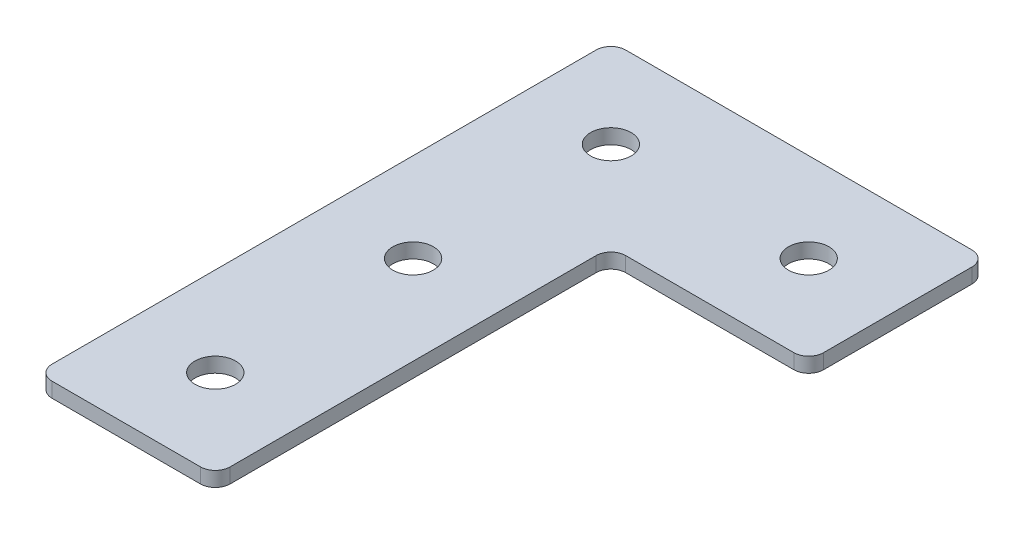
ISO-10303-21;
HEADER;
FILE_DESCRIPTION(('STEP AP214'),'2;1');
FILE_NAME('part.step','',(''),(''),'','','');
FILE_SCHEMA(('AUTOMOTIVE_DESIGN { 1 0 10303 214 1 1 1 1 }'));
ENDSEC;
DATA;
#1=APPLICATION_CONTEXT('core data for automotive mechanical design processes');
#2=APPLICATION_PROTOCOL_DEFINITION('international standard','automotive_design',2000,#1);
#3=PRODUCT_CONTEXT('',#1,'mechanical');
#4=PRODUCT('Part','Part','',(#3));
#5=PRODUCT_RELATED_PRODUCT_CATEGORY('part','',(#4));
#6=PRODUCT_DEFINITION_FORMATION('','',#4);
#7=PRODUCT_DEFINITION_CONTEXT('part definition',#1,'design');
#8=PRODUCT_DEFINITION('design','',#6,#7);
#9=PRODUCT_DEFINITION_SHAPE('','',#8);
#10=(LENGTH_UNIT() NAMED_UNIT(*) SI_UNIT(.MILLI.,.METRE.));
#11=(NAMED_UNIT(*) PLANE_ANGLE_UNIT() SI_UNIT($,.RADIAN.));
#12=(NAMED_UNIT(*) SI_UNIT($,.STERADIAN.) SOLID_ANGLE_UNIT());
#13=UNCERTAINTY_MEASURE_WITH_UNIT(LENGTH_MEASURE(1.E-05),#10,'distance_accuracy_value','');
#14=(GEOMETRIC_REPRESENTATION_CONTEXT(3) GLOBAL_UNCERTAINTY_ASSIGNED_CONTEXT((#13)) GLOBAL_UNIT_ASSIGNED_CONTEXT((#10,
#11,#12)) REPRESENTATION_CONTEXT('',''));
#15=CARTESIAN_POINT('',(0.,0.,0.));
#16=DIRECTION('',(0.,0.,1.));
#17=DIRECTION('',(1.,0.,0.));
#18=AXIS2_PLACEMENT_3D('',#15,#16,#17);
#19=CARTESIAN_POINT('',(-21.1576061309029,0.991348310286412,-41.3333372983197));
#20=DIRECTION('',(0.,-1.,0.));
#21=DIRECTION('',(0.,0.,-1.));
#22=AXIS2_PLACEMENT_3D('',#19,#20,#21);
#23=PLANE('',#22);
#24=CARTESIAN_POINT('',(-21.1576061309029,0.991348310286412,38.6666627016803));
#25=DIRECTION('',(0.,1.,0.));
#26=DIRECTION('',(0.,0.,1.));
#27=AXIS2_PLACEMENT_3D('',#24,#25,#26);
#28=CIRCLE('',#27,4.1);
#29=CARTESIAN_POINT('',(-21.1576061309029,0.991348310286412,42.7666627016803));
#30=VERTEX_POINT('',#29);
#31=EDGE_CURVE('E234',#30,#30,#28,.T.);
#32=ORIENTED_EDGE('',*,*,#31,.T.);
#33=EDGE_LOOP('',(#32));
#34=FACE_BOUND('',#33,.T.);
#35=CARTESIAN_POINT('',(-21.1576061309029,0.991348310286412,-1.33333729831971));
#36=DIRECTION('',(0.,1.,0.));
#37=DIRECTION('',(0.,0.,1.));
#38=AXIS2_PLACEMENT_3D('',#35,#36,#37);
#39=CIRCLE('',#38,4.1);
#40=CARTESIAN_POINT('',(-21.1576061309029,0.991348310286412,2.76666270168029));
#41=VERTEX_POINT('',#40);
#42=EDGE_CURVE('E228',#41,#41,#39,.T.);
#43=ORIENTED_EDGE('',*,*,#42,.T.);
#44=EDGE_LOOP('',(#43));
#45=FACE_BOUND('',#44,.T.);
#46=CARTESIAN_POINT('',(18.8423938690971,0.991348310286412,-41.3333372983197));
#47=DIRECTION('',(0.,1.,0.));
#48=DIRECTION('',(0.,0.,1.));
#49=AXIS2_PLACEMENT_3D('',#46,#47,#48);
#50=CIRCLE('',#49,4.1);
#51=CARTESIAN_POINT('',(18.8423938690971,0.991348310286412,-37.2333372983197));
#52=VERTEX_POINT('',#51);
#53=EDGE_CURVE('E222',#52,#52,#50,.T.);
#54=ORIENTED_EDGE('',*,*,#53,.T.);
#55=EDGE_LOOP('',(#54));
#56=FACE_BOUND('',#55,.T.);
#57=CARTESIAN_POINT('',(-21.1576061309029,0.991348310286412,-41.3333372983197));
#58=DIRECTION('',(0.,1.,0.));
#59=DIRECTION('',(0.,0.,1.));
#60=AXIS2_PLACEMENT_3D('',#57,#58,#59);
#61=CIRCLE('',#60,4.1);
#62=CARTESIAN_POINT('',(-21.1576061309029,0.991348310286412,-37.2333372983197));
#63=VERTEX_POINT('',#62);
#64=EDGE_CURVE('E201',#63,#63,#61,.T.);
#65=ORIENTED_EDGE('',*,*,#64,.T.);
#66=EDGE_LOOP('',(#65));
#67=FACE_BOUND('',#66,.T.);
#68=DIRECTION('',(1.,0.,0.));
#69=VECTOR('',#68,1.);
#70=CARTESIAN_POINT('',(-39.1576061309029,0.991348310286412,56.6666627016803));
#71=LINE('',#70,#69);
#72=CARTESIAN_POINT('',(-36.1576061309029,0.991348310286412,56.6666627016803));
#73=VERTEX_POINT('',#72);
#74=CARTESIAN_POINT('',(-6.15760613090292,0.991348310286412,56.6666627016803));
#75=VERTEX_POINT('',#74);
#76=EDGE_CURVE('E191',#73,#75,#71,.T.);
#77=ORIENTED_EDGE('',*,*,#76,.F.);
#78=CARTESIAN_POINT('',(-36.1576061309029,0.991348310286412,53.6666627016803));
#79=DIRECTION('',(0.,-1.,0.));
#80=DIRECTION('',(0.,0.,-1.));
#81=AXIS2_PLACEMENT_3D('',#78,#79,#80);
#82=CIRCLE('',#81,3.);
#83=CARTESIAN_POINT('',(-39.1576061309029,0.991348310286412,53.6666627016802));
#84=VERTEX_POINT('',#83);
#85=EDGE_CURVE('E158',#73,#84,#82,.T.);
#86=ORIENTED_EDGE('',*,*,#85,.T.);
#87=DIRECTION('',(0.,0.,1.));
#88=VECTOR('',#87,1.);
#89=CARTESIAN_POINT('',(-39.1576061309029,0.991348310286412,-59.3333372983197));
#90=LINE('',#89,#88);
#91=CARTESIAN_POINT('',(-39.1576061309029,0.991348310286412,-56.3333372983197));
#92=VERTEX_POINT('',#91);
#93=EDGE_CURVE('E194',#92,#84,#90,.T.);
#94=ORIENTED_EDGE('',*,*,#93,.F.);
#95=CARTESIAN_POINT('',(-36.1576061309029,0.991348310286412,-56.3333372983197));
#96=DIRECTION('',(0.,-1.,0.));
#97=DIRECTION('',(0.,0.,-1.));
#98=AXIS2_PLACEMENT_3D('',#95,#96,#97);
#99=CIRCLE('',#98,3.);
#100=CARTESIAN_POINT('',(-36.1576061309029,0.991348310286412,-59.3333372983197));
#101=VERTEX_POINT('',#100);
#102=EDGE_CURVE('E128',#92,#101,#99,.T.);
#103=ORIENTED_EDGE('',*,*,#102,.T.);
#104=DIRECTION('',(-1.,0.,0.));
#105=VECTOR('',#104,1.);
#106=CARTESIAN_POINT('',(36.8423938690971,0.991348310286412,-59.3333372983197));
#107=LINE('',#106,#105);
#108=CARTESIAN_POINT('',(33.8423938690971,0.991348310286412,-59.3333372983197));
#109=VERTEX_POINT('',#108);
#110=EDGE_CURVE('E213',#109,#101,#107,.T.);
#111=ORIENTED_EDGE('',*,*,#110,.F.);
#112=CARTESIAN_POINT('',(33.8423938690971,0.991348310286412,-56.3333372983198));
#113=DIRECTION('',(0.,-1.,0.));
#114=DIRECTION('',(0.,0.,-1.));
#115=AXIS2_PLACEMENT_3D('',#112,#113,#114);
#116=CIRCLE('',#115,3.);
#117=CARTESIAN_POINT('',(36.8423938690971,0.991348310286412,-56.3333372983198));
#118=VERTEX_POINT('',#117);
#119=EDGE_CURVE('E152',#109,#118,#116,.T.);
#120=ORIENTED_EDGE('',*,*,#119,.T.);
#121=DIRECTION('',(0.,0.,-1.));
#122=VECTOR('',#121,1.);
#123=CARTESIAN_POINT('',(36.8423938690971,0.991348310286412,-23.3333372983197));
#124=LINE('',#123,#122);
#125=CARTESIAN_POINT('',(36.8423938690971,0.991348310286412,-26.3333372983197));
#126=VERTEX_POINT('',#125);
#127=EDGE_CURVE('E187',#126,#118,#124,.T.);
#128=ORIENTED_EDGE('',*,*,#127,.F.);
#129=CARTESIAN_POINT('',(33.8423938690971,0.991348310286412,-26.3333372983197));
#130=DIRECTION('',(0.,-1.,0.));
#131=DIRECTION('',(0.,0.,-1.));
#132=AXIS2_PLACEMENT_3D('',#129,#130,#131);
#133=CIRCLE('',#132,3.);
#134=CARTESIAN_POINT('',(33.8423938690971,0.991348310286412,-23.3333372983197));
#135=VERTEX_POINT('',#134);
#136=EDGE_CURVE('E154',#126,#135,#133,.T.);
#137=ORIENTED_EDGE('',*,*,#136,.T.);
#138=DIRECTION('',(1.,0.,0.));
#139=VECTOR('',#138,1.);
#140=CARTESIAN_POINT('',(-3.15760613090292,0.991348310286412,-23.3333372983197));
#141=LINE('',#140,#139);
#142=CARTESIAN_POINT('',(-0.157606130902922,0.991348310286412,-23.3333372983197));
#143=VERTEX_POINT('',#142);
#144=EDGE_CURVE('E129',#143,#135,#141,.T.);
#145=ORIENTED_EDGE('',*,*,#144,.F.);
#146=CARTESIAN_POINT('',(-0.157606130902922,0.991348310286412,-20.3333372983197));
#147=DIRECTION('',(0.,-1.,0.));
#148=DIRECTION('',(0.,0.,-1.));
#149=AXIS2_PLACEMENT_3D('',#146,#147,#148);
#150=CIRCLE('',#149,3.);
#151=CARTESIAN_POINT('',(-3.15760613090292,0.991348310286412,-20.3333372983197));
#152=VERTEX_POINT('',#151);
#153=EDGE_CURVE('E10',#143,#152,#150,.F.);
#154=ORIENTED_EDGE('',*,*,#153,.T.);
#155=DIRECTION('',(0.,0.,-1.));
#156=VECTOR('',#155,1.);
#157=CARTESIAN_POINT('',(-3.15760613090292,0.991348310286412,56.6666627016803));
#158=LINE('',#157,#156);
#159=CARTESIAN_POINT('',(-3.15760613090292,0.991348310286412,53.6666627016803));
#160=VERTEX_POINT('',#159);
#161=EDGE_CURVE('E133',#160,#152,#158,.T.);
#162=ORIENTED_EDGE('',*,*,#161,.F.);
#163=CARTESIAN_POINT('',(-6.15760613090292,0.991348310286412,53.6666627016803));
#164=DIRECTION('',(0.,-1.,0.));
#165=DIRECTION('',(0.,0.,-1.));
#166=AXIS2_PLACEMENT_3D('',#163,#164,#165);
#167=CIRCLE('',#166,3.);
#168=EDGE_CURVE('E156',#160,#75,#167,.T.);
#169=ORIENTED_EDGE('',*,*,#168,.T.);
#170=EDGE_LOOP('',(#77,#86,#94,#103,#111,#120,#128,#137,#145,#154,#162,#169));
#171=FACE_BOUND('',#170,.T.);
#172=ADVANCED_FACE('F16',(#34,#45,#56,#67,#171),#23,.T.);
#173=CARTESIAN_POINT('',(36.8423938690971,0.991348310286412,-23.3333372983197));
#174=DIRECTION('',(1.,0.,0.));
#175=DIRECTION('',(0.,0.,-1.));
#176=AXIS2_PLACEMENT_3D('',#173,#174,#175);
#177=PLANE('',#176);
#178=DIRECTION('',(0.,0.,-1.));
#179=VECTOR('',#178,1.);
#180=CARTESIAN_POINT('',(36.8423938690971,3.99134831028641,-23.3333372983197));
#181=LINE('',#180,#179);
#182=CARTESIAN_POINT('',(36.8423938690971,3.99134831028641,-26.3333372983197));
#183=VERTEX_POINT('',#182);
#184=CARTESIAN_POINT('',(36.8423938690971,3.99134831028641,-56.3333372983198));
#185=VERTEX_POINT('',#184);
#186=EDGE_CURVE('E198',#183,#185,#181,.T.);
#187=ORIENTED_EDGE('',*,*,#186,.F.);
#188=DIRECTION('',(0.,1.,0.));
#189=VECTOR('',#188,1.);
#190=CARTESIAN_POINT('',(36.8423938690971,0.991348310286412,-26.3333372983197));
#191=LINE('',#190,#189);
#192=EDGE_CURVE('E172',#183,#126,#191,.F.);
#193=ORIENTED_EDGE('',*,*,#192,.T.);
#194=ORIENTED_EDGE('',*,*,#127,.T.);
#195=DIRECTION('',(0.,1.,0.));
#196=VECTOR('',#195,1.);
#197=CARTESIAN_POINT('',(36.8423938690971,0.991348310286412,-56.3333372983198));
#198=LINE('',#197,#196);
#199=EDGE_CURVE('E169',#118,#185,#198,.T.);
#200=ORIENTED_EDGE('',*,*,#199,.T.);
#201=EDGE_LOOP('',(#187,#193,#194,#200));
#202=FACE_BOUND('',#201,.T.);
#203=ADVANCED_FACE('F278',(#202),#177,.T.);
#204=CARTESIAN_POINT('',(-3.15760613090292,0.991348310286412,-23.3333372983197));
#205=DIRECTION('',(0.,0.,1.));
#206=DIRECTION('',(1.,0.,0.));
#207=AXIS2_PLACEMENT_3D('',#204,#205,#206);
#208=PLANE('',#207);
#209=DIRECTION('',(1.,0.,0.));
#210=VECTOR('',#209,1.);
#211=CARTESIAN_POINT('',(-3.15760613090292,3.99134831028641,-23.3333372983197));
#212=LINE('',#211,#210);
#213=CARTESIAN_POINT('',(-0.157606130902922,3.99134831028641,-23.3333372983197));
#214=VERTEX_POINT('',#213);
#215=CARTESIAN_POINT('',(33.8423938690971,3.99134831028641,-23.3333372983197));
#216=VERTEX_POINT('',#215);
#217=EDGE_CURVE('E136',#214,#216,#212,.T.);
#218=ORIENTED_EDGE('',*,*,#217,.F.);
#219=DIRECTION('',(0.,1.,0.));
#220=VECTOR('',#219,1.);
#221=CARTESIAN_POINT('',(-0.157606130902922,0.991348310286412,-23.3333372983197));
#222=LINE('',#221,#220);
#223=EDGE_CURVE('E167',#214,#143,#222,.F.);
#224=ORIENTED_EDGE('',*,*,#223,.T.);
#225=ORIENTED_EDGE('',*,*,#144,.T.);
#226=DIRECTION('',(0.,1.,0.));
#227=VECTOR('',#226,1.);
#228=CARTESIAN_POINT('',(33.8423938690971,0.991348310286412,-23.3333372983197));
#229=LINE('',#228,#227);
#230=EDGE_CURVE('E164',#135,#216,#229,.T.);
#231=ORIENTED_EDGE('',*,*,#230,.T.);
#232=EDGE_LOOP('',(#218,#224,#225,#231));
#233=FACE_BOUND('',#232,.T.);
#234=ADVANCED_FACE('F185',(#233),#208,.T.);
#235=CARTESIAN_POINT('',(-3.15760613090292,0.991348310286412,56.6666627016803));
#236=DIRECTION('',(1.,0.,0.));
#237=DIRECTION('',(0.,0.,-1.));
#238=AXIS2_PLACEMENT_3D('',#235,#236,#237);
#239=PLANE('',#238);
#240=DIRECTION('',(0.,0.,-1.));
#241=VECTOR('',#240,1.);
#242=CARTESIAN_POINT('',(-3.15760613090292,3.99134831028641,56.6666627016803));
#243=LINE('',#242,#241);
#244=CARTESIAN_POINT('',(-3.15760613090292,3.99134831028641,53.6666627016803));
#245=VERTEX_POINT('',#244);
#246=CARTESIAN_POINT('',(-3.15760613090292,3.99134831028641,-20.3333372983197));
#247=VERTEX_POINT('',#246);
#248=EDGE_CURVE('E180',#245,#247,#243,.T.);
#249=ORIENTED_EDGE('',*,*,#248,.F.);
#250=DIRECTION('',(0.,1.,0.));
#251=VECTOR('',#250,1.);
#252=CARTESIAN_POINT('',(-3.15760613090292,0.991348310286412,53.6666627016803));
#253=LINE('',#252,#251);
#254=EDGE_CURVE('E36',#245,#160,#253,.F.);
#255=ORIENTED_EDGE('',*,*,#254,.T.);
#256=ORIENTED_EDGE('',*,*,#161,.T.);
#257=DIRECTION('',(0.,1.,0.));
#258=VECTOR('',#257,1.);
#259=CARTESIAN_POINT('',(-3.15760613090292,3.99134831028641,-20.3333372983197));
#260=LINE('',#259,#258);
#261=EDGE_CURVE('E160',#152,#247,#260,.T.);
#262=ORIENTED_EDGE('',*,*,#261,.T.);
#263=EDGE_LOOP('',(#249,#255,#256,#262));
#264=FACE_BOUND('',#263,.T.);
#265=ADVANCED_FACE('F189',(#264),#239,.T.);
#266=CARTESIAN_POINT('',(-39.1576061309029,0.991348310286412,56.6666627016803));
#267=DIRECTION('',(0.,0.,1.));
#268=DIRECTION('',(1.,0.,0.));
#269=AXIS2_PLACEMENT_3D('',#266,#267,#268);
#270=PLANE('',#269);
#271=DIRECTION('',(1.,0.,0.));
#272=VECTOR('',#271,1.);
#273=CARTESIAN_POINT('',(-39.1576061309029,3.99134831028641,56.6666627016803));
#274=LINE('',#273,#272);
#275=CARTESIAN_POINT('',(-36.1576061309029,3.99134831028641,56.6666627016803));
#276=VERTEX_POINT('',#275);
#277=CARTESIAN_POINT('',(-6.15760613090292,3.99134831028641,56.6666627016803));
#278=VERTEX_POINT('',#277);
#279=EDGE_CURVE('E125',#276,#278,#274,.T.);
#280=ORIENTED_EDGE('',*,*,#279,.F.);
#281=DIRECTION('',(0.,1.,0.));
#282=VECTOR('',#281,1.);
#283=CARTESIAN_POINT('',(-36.1576061309029,0.991348310286412,56.6666627016803));
#284=LINE('',#283,#282);
#285=EDGE_CURVE('E149',#276,#73,#284,.F.);
#286=ORIENTED_EDGE('',*,*,#285,.T.);
#287=ORIENTED_EDGE('',*,*,#76,.T.);
#288=DIRECTION('',(0.,1.,0.));
#289=VECTOR('',#288,1.);
#290=CARTESIAN_POINT('',(-6.15760613090292,0.991348310286412,56.6666627016803));
#291=LINE('',#290,#289);
#292=EDGE_CURVE('E146',#75,#278,#291,.T.);
#293=ORIENTED_EDGE('',*,*,#292,.T.);
#294=EDGE_LOOP('',(#280,#286,#287,#293));
#295=FACE_BOUND('',#294,.T.);
#296=ADVANCED_FACE('F207',(#295),#270,.T.);
#297=CARTESIAN_POINT('',(-39.1576061309029,0.991348310286412,-59.3333372983197));
#298=DIRECTION('',(-1.,0.,0.));
#299=DIRECTION('',(0.,0.,1.));
#300=AXIS2_PLACEMENT_3D('',#297,#298,#299);
#301=PLANE('',#300);
#302=ORIENTED_EDGE('',*,*,#93,.T.);
#303=DIRECTION('',(0.,1.,0.));
#304=VECTOR('',#303,1.);
#305=CARTESIAN_POINT('',(-39.1576061309029,0.991348310286412,53.6666627016803));
#306=LINE('',#305,#304);
#307=CARTESIAN_POINT('',(-39.1576061309029,3.99134831028641,53.6666627016802));
#308=VERTEX_POINT('',#307);
#309=EDGE_CURVE('E116',#84,#308,#306,.T.);
#310=ORIENTED_EDGE('',*,*,#309,.T.);
#311=DIRECTION('',(0.,0.,1.));
#312=VECTOR('',#311,1.);
#313=CARTESIAN_POINT('',(-39.1576061309029,3.99134831028641,-59.3333372983197));
#314=LINE('',#313,#312);
#315=CARTESIAN_POINT('',(-39.1576061309029,3.99134831028641,-56.3333372983197));
#316=VERTEX_POINT('',#315);
#317=EDGE_CURVE('E108',#316,#308,#314,.T.);
#318=ORIENTED_EDGE('',*,*,#317,.F.);
#319=DIRECTION('',(0.,1.,0.));
#320=VECTOR('',#319,1.);
#321=CARTESIAN_POINT('',(-39.1576061309029,0.991348310286412,-56.3333372983197));
#322=LINE('',#321,#320);
#323=EDGE_CURVE('E122',#316,#92,#322,.F.);
#324=ORIENTED_EDGE('',*,*,#323,.T.);
#325=EDGE_LOOP('',(#302,#310,#318,#324));
#326=FACE_BOUND('',#325,.T.);
#327=ADVANCED_FACE('F121',(#326),#301,.T.);
#328=CARTESIAN_POINT('',(36.8423938690971,0.991348310286412,-59.3333372983197));
#329=DIRECTION('',(0.,0.,-1.));
#330=DIRECTION('',(-1.,0.,0.));
#331=AXIS2_PLACEMENT_3D('',#328,#329,#330);
#332=PLANE('',#331);
#333=DIRECTION('',(-1.,0.,0.));
#334=VECTOR('',#333,1.);
#335=CARTESIAN_POINT('',(36.8423938690971,3.99134831028641,-59.3333372983197));
#336=LINE('',#335,#334);
#337=CARTESIAN_POINT('',(33.8423938690971,3.99134831028641,-59.3333372983197));
#338=VERTEX_POINT('',#337);
#339=CARTESIAN_POINT('',(-36.1576061309029,3.99134831028641,-59.3333372983197));
#340=VERTEX_POINT('',#339);
#341=EDGE_CURVE('E110',#338,#340,#336,.T.);
#342=ORIENTED_EDGE('',*,*,#341,.F.);
#343=DIRECTION('',(0.,1.,0.));
#344=VECTOR('',#343,1.);
#345=CARTESIAN_POINT('',(33.8423938690971,0.991348310286412,-59.3333372983197));
#346=LINE('',#345,#344);
#347=EDGE_CURVE('E176',#338,#109,#346,.F.);
#348=ORIENTED_EDGE('',*,*,#347,.T.);
#349=ORIENTED_EDGE('',*,*,#110,.T.);
#350=DIRECTION('',(0.,1.,0.));
#351=VECTOR('',#350,1.);
#352=CARTESIAN_POINT('',(-36.1576061309029,0.991348310286412,-59.3333372983197));
#353=LINE('',#352,#351);
#354=EDGE_CURVE('E174',#101,#340,#353,.T.);
#355=ORIENTED_EDGE('',*,*,#354,.T.);
#356=EDGE_LOOP('',(#342,#348,#349,#355));
#357=FACE_BOUND('',#356,.T.);
#358=ADVANCED_FACE('F254',(#357),#332,.T.);
#359=CARTESIAN_POINT('',(-21.1576061309029,3.99134831028641,-41.3333372983197));
#360=DIRECTION('',(0.,-1.,0.));
#361=DIRECTION('',(0.,0.,-1.));
#362=AXIS2_PLACEMENT_3D('',#359,#360,#361);
#363=PLANE('',#362);
#364=CARTESIAN_POINT('',(-21.1576061309029,3.99134831028641,38.6666627016803));
#365=DIRECTION('',(0.,1.,0.));
#366=DIRECTION('',(0.,0.,1.));
#367=AXIS2_PLACEMENT_3D('',#364,#365,#366);
#368=CIRCLE('',#367,4.1);
#369=CARTESIAN_POINT('',(-21.1576061309029,3.99134831028641,42.7666627016803));
#370=VERTEX_POINT('',#369);
#371=EDGE_CURVE('E237',#370,#370,#368,.T.);
#372=ORIENTED_EDGE('',*,*,#371,.F.);
#373=EDGE_LOOP('',(#372));
#374=FACE_BOUND('',#373,.T.);
#375=CARTESIAN_POINT('',(-21.1576061309029,3.99134831028641,-1.33333729831971));
#376=DIRECTION('',(0.,1.,0.));
#377=DIRECTION('',(0.,0.,1.));
#378=AXIS2_PLACEMENT_3D('',#375,#376,#377);
#379=CIRCLE('',#378,4.1);
#380=CARTESIAN_POINT('',(-21.1576061309029,3.99134831028641,2.76666270168029));
#381=VERTEX_POINT('',#380);
#382=EDGE_CURVE('E231',#381,#381,#379,.T.);
#383=ORIENTED_EDGE('',*,*,#382,.F.);
#384=EDGE_LOOP('',(#383));
#385=FACE_BOUND('',#384,.T.);
#386=CARTESIAN_POINT('',(18.8423938690971,3.99134831028641,-41.3333372983197));
#387=DIRECTION('',(0.,1.,0.));
#388=DIRECTION('',(0.,0.,1.));
#389=AXIS2_PLACEMENT_3D('',#386,#387,#388);
#390=CIRCLE('',#389,4.1);
#391=CARTESIAN_POINT('',(18.8423938690971,3.99134831028641,-37.2333372983197));
#392=VERTEX_POINT('',#391);
#393=EDGE_CURVE('E225',#392,#392,#390,.T.);
#394=ORIENTED_EDGE('',*,*,#393,.F.);
#395=EDGE_LOOP('',(#394));
#396=FACE_BOUND('',#395,.T.);
#397=CARTESIAN_POINT('',(-21.1576061309029,3.99134831028641,-41.3333372983197));
#398=DIRECTION('',(0.,1.,0.));
#399=DIRECTION('',(0.,0.,1.));
#400=AXIS2_PLACEMENT_3D('',#397,#398,#399);
#401=CIRCLE('',#400,4.1);
#402=CARTESIAN_POINT('',(-21.1576061309029,3.99134831028641,-37.2333372983197));
#403=VERTEX_POINT('',#402);
#404=EDGE_CURVE('E219',#403,#403,#401,.T.);
#405=ORIENTED_EDGE('',*,*,#404,.F.);
#406=EDGE_LOOP('',(#405));
#407=FACE_BOUND('',#406,.T.);
#408=ORIENTED_EDGE('',*,*,#317,.T.);
#409=CARTESIAN_POINT('',(-36.1576061309029,3.99134831028641,53.6666627016803));
#410=DIRECTION('',(0.,-1.,0.));
#411=DIRECTION('',(0.,0.,-1.));
#412=AXIS2_PLACEMENT_3D('',#409,#410,#411);
#413=CIRCLE('',#412,3.);
#414=EDGE_CURVE('E144',#308,#276,#413,.F.);
#415=ORIENTED_EDGE('',*,*,#414,.T.);
#416=ORIENTED_EDGE('',*,*,#279,.T.);
#417=CARTESIAN_POINT('',(-6.15760613090292,3.99134831028641,53.6666627016803));
#418=DIRECTION('',(0.,-1.,0.));
#419=DIRECTION('',(0.,0.,-1.));
#420=AXIS2_PLACEMENT_3D('',#417,#418,#419);
#421=CIRCLE('',#420,3.);
#422=EDGE_CURVE('E142',#278,#245,#421,.F.);
#423=ORIENTED_EDGE('',*,*,#422,.T.);
#424=ORIENTED_EDGE('',*,*,#248,.T.);
#425=CARTESIAN_POINT('',(-0.157606130902922,3.99134831028641,-20.3333372983197));
#426=DIRECTION('',(0.,-1.,0.));
#427=DIRECTION('',(0.,0.,-1.));
#428=AXIS2_PLACEMENT_3D('',#425,#426,#427);
#429=CIRCLE('',#428,3.);
#430=EDGE_CURVE('E24',#247,#214,#429,.T.);
#431=ORIENTED_EDGE('',*,*,#430,.T.);
#432=ORIENTED_EDGE('',*,*,#217,.T.);
#433=CARTESIAN_POINT('',(33.8423938690971,3.99134831028641,-26.3333372983197));
#434=DIRECTION('',(0.,-1.,0.));
#435=DIRECTION('',(0.,0.,-1.));
#436=AXIS2_PLACEMENT_3D('',#433,#434,#435);
#437=CIRCLE('',#436,3.);
#438=EDGE_CURVE('E140',#216,#183,#437,.F.);
#439=ORIENTED_EDGE('',*,*,#438,.T.);
#440=ORIENTED_EDGE('',*,*,#186,.T.);
#441=CARTESIAN_POINT('',(33.8423938690971,3.99134831028641,-56.3333372983198));
#442=DIRECTION('',(0.,-1.,0.));
#443=DIRECTION('',(0.,0.,-1.));
#444=AXIS2_PLACEMENT_3D('',#441,#442,#443);
#445=CIRCLE('',#444,3.);
#446=EDGE_CURVE('E115',#185,#338,#445,.F.);
#447=ORIENTED_EDGE('',*,*,#446,.T.);
#448=ORIENTED_EDGE('',*,*,#341,.T.);
#449=CARTESIAN_POINT('',(-36.1576061309029,3.99134831028641,-56.3333372983197));
#450=DIRECTION('',(0.,-1.,0.));
#451=DIRECTION('',(0.,0.,-1.));
#452=AXIS2_PLACEMENT_3D('',#449,#450,#451);
#453=CIRCLE('',#452,3.);
#454=EDGE_CURVE('E105',#340,#316,#453,.F.);
#455=ORIENTED_EDGE('',*,*,#454,.T.);
#456=EDGE_LOOP('',(#408,#415,#416,#423,#424,#431,#432,#439,#440,#447,#448,#455));
#457=FACE_BOUND('',#456,.T.);
#458=ADVANCED_FACE('F107',(#374,#385,#396,#407,#457),#363,.F.);
#459=CARTESIAN_POINT('',(-36.1576061309029,0.991348310286412,53.6666627016803));
#460=DIRECTION('',(0.,1.,0.));
#461=DIRECTION('',(0.,0.,1.));
#462=AXIS2_PLACEMENT_3D('',#459,#460,#461);
#463=CYLINDRICAL_SURFACE('',#462,3.);
#464=ORIENTED_EDGE('',*,*,#85,.F.);
#465=ORIENTED_EDGE('',*,*,#285,.F.);
#466=ORIENTED_EDGE('',*,*,#414,.F.);
#467=ORIENTED_EDGE('',*,*,#309,.F.);
#468=EDGE_LOOP('',(#464,#465,#466,#467));
#469=FACE_BOUND('',#468,.T.);
#470=ADVANCED_FACE('F212',(#469),#463,.T.);
#471=CARTESIAN_POINT('',(-6.15760613090292,0.991348310286412,53.6666627016803));
#472=DIRECTION('',(0.,1.,0.));
#473=DIRECTION('',(0.,0.,1.));
#474=AXIS2_PLACEMENT_3D('',#471,#472,#473);
#475=CYLINDRICAL_SURFACE('',#474,3.);
#476=ORIENTED_EDGE('',*,*,#168,.F.);
#477=ORIENTED_EDGE('',*,*,#254,.F.);
#478=ORIENTED_EDGE('',*,*,#422,.F.);
#479=ORIENTED_EDGE('',*,*,#292,.F.);
#480=EDGE_LOOP('',(#476,#477,#478,#479));
#481=FACE_BOUND('',#480,.T.);
#482=ADVANCED_FACE('F288',(#481),#475,.T.);
#483=CARTESIAN_POINT('',(-0.157606130902922,0.991348310286412,-20.3333372983197));
#484=DIRECTION('',(0.,-1.,0.));
#485=DIRECTION('',(0.,0.,-1.));
#486=AXIS2_PLACEMENT_3D('',#483,#484,#485);
#487=CYLINDRICAL_SURFACE('',#486,3.);
#488=ORIENTED_EDGE('',*,*,#153,.F.);
#489=ORIENTED_EDGE('',*,*,#223,.F.);
#490=ORIENTED_EDGE('',*,*,#430,.F.);
#491=ORIENTED_EDGE('',*,*,#261,.F.);
#492=EDGE_LOOP('',(#488,#489,#490,#491));
#493=FACE_BOUND('',#492,.T.);
#494=ADVANCED_FACE('F188',(#493),#487,.F.);
#495=CARTESIAN_POINT('',(33.8423938690971,0.991348310286412,-26.3333372983197));
#496=DIRECTION('',(0.,1.,0.));
#497=DIRECTION('',(0.,0.,1.));
#498=AXIS2_PLACEMENT_3D('',#495,#496,#497);
#499=CYLINDRICAL_SURFACE('',#498,3.);
#500=ORIENTED_EDGE('',*,*,#136,.F.);
#501=ORIENTED_EDGE('',*,*,#192,.F.);
#502=ORIENTED_EDGE('',*,*,#438,.F.);
#503=ORIENTED_EDGE('',*,*,#230,.F.);
#504=EDGE_LOOP('',(#500,#501,#502,#503));
#505=FACE_BOUND('',#504,.T.);
#506=ADVANCED_FACE('F294',(#505),#499,.T.);
#507=CARTESIAN_POINT('',(33.8423938690971,0.991348310286412,-56.3333372983198));
#508=DIRECTION('',(0.,1.,0.));
#509=DIRECTION('',(0.,0.,1.));
#510=AXIS2_PLACEMENT_3D('',#507,#508,#509);
#511=CYLINDRICAL_SURFACE('',#510,3.);
#512=ORIENTED_EDGE('',*,*,#119,.F.);
#513=ORIENTED_EDGE('',*,*,#347,.F.);
#514=ORIENTED_EDGE('',*,*,#446,.F.);
#515=ORIENTED_EDGE('',*,*,#199,.F.);
#516=EDGE_LOOP('',(#512,#513,#514,#515));
#517=FACE_BOUND('',#516,.T.);
#518=ADVANCED_FACE('F274',(#517),#511,.T.);
#519=CARTESIAN_POINT('',(-36.1576061309029,0.991348310286412,-56.3333372983197));
#520=DIRECTION('',(0.,1.,0.));
#521=DIRECTION('',(0.,0.,1.));
#522=AXIS2_PLACEMENT_3D('',#519,#520,#521);
#523=CYLINDRICAL_SURFACE('',#522,3.);
#524=ORIENTED_EDGE('',*,*,#102,.F.);
#525=ORIENTED_EDGE('',*,*,#323,.F.);
#526=ORIENTED_EDGE('',*,*,#454,.F.);
#527=ORIENTED_EDGE('',*,*,#354,.F.);
#528=EDGE_LOOP('',(#524,#525,#526,#527));
#529=FACE_BOUND('',#528,.T.);
#530=ADVANCED_FACE('F18',(#529),#523,.T.);
#531=CARTESIAN_POINT('',(-21.1576061309029,0.991348310286412,-41.3333372983197));
#532=DIRECTION('',(0.,1.,0.));
#533=DIRECTION('',(0.,0.,1.));
#534=AXIS2_PLACEMENT_3D('',#531,#532,#533);
#535=CYLINDRICAL_SURFACE('',#534,4.1);
#536=ORIENTED_EDGE('',*,*,#64,.F.);
#537=EDGE_LOOP('',(#536));
#538=FACE_BOUND('',#537,.T.);
#539=ORIENTED_EDGE('',*,*,#404,.T.);
#540=EDGE_LOOP('',(#539));
#541=FACE_BOUND('',#540,.T.);
#542=ADVANCED_FACE('F262',(#538,#541),#535,.F.);
#543=CARTESIAN_POINT('',(18.8423938690971,0.991348310286412,-41.3333372983197));
#544=DIRECTION('',(0.,1.,0.));
#545=DIRECTION('',(0.,0.,1.));
#546=AXIS2_PLACEMENT_3D('',#543,#544,#545);
#547=CYLINDRICAL_SURFACE('',#546,4.1);
#548=ORIENTED_EDGE('',*,*,#53,.F.);
#549=EDGE_LOOP('',(#548));
#550=FACE_BOUND('',#549,.T.);
#551=ORIENTED_EDGE('',*,*,#393,.T.);
#552=EDGE_LOOP('',(#551));
#553=FACE_BOUND('',#552,.T.);
#554=ADVANCED_FACE('F264',(#550,#553),#547,.F.);
#555=CARTESIAN_POINT('',(-21.1576061309029,0.991348310286412,-1.33333729831971));
#556=DIRECTION('',(0.,1.,0.));
#557=DIRECTION('',(0.,0.,1.));
#558=AXIS2_PLACEMENT_3D('',#555,#556,#557);
#559=CYLINDRICAL_SURFACE('',#558,4.1);
#560=ORIENTED_EDGE('',*,*,#42,.F.);
#561=EDGE_LOOP('',(#560));
#562=FACE_BOUND('',#561,.T.);
#563=ORIENTED_EDGE('',*,*,#382,.T.);
#564=EDGE_LOOP('',(#563));
#565=FACE_BOUND('',#564,.T.);
#566=ADVANCED_FACE('F248',(#562,#565),#559,.F.);
#567=CARTESIAN_POINT('',(-21.1576061309029,0.991348310286412,38.6666627016803));
#568=DIRECTION('',(0.,1.,0.));
#569=DIRECTION('',(0.,0.,1.));
#570=AXIS2_PLACEMENT_3D('',#567,#568,#569);
#571=CYLINDRICAL_SURFACE('',#570,4.1);
#572=ORIENTED_EDGE('',*,*,#31,.F.);
#573=EDGE_LOOP('',(#572));
#574=FACE_BOUND('',#573,.T.);
#575=ORIENTED_EDGE('',*,*,#371,.T.);
#576=EDGE_LOOP('',(#575));
#577=FACE_BOUND('',#576,.T.);
#578=ADVANCED_FACE('F245',(#574,#577),#571,.F.);
#579=CLOSED_SHELL('',(#172,#203,#234,#265,#296,#327,#358,#458,#470,#482,#494,#506,#518,#530,
#542,#554,#566,#578));
#580=MANIFOLD_SOLID_BREP('B1',#579);
#581=ADVANCED_BREP_SHAPE_REPRESENTATION('',(#18,#580),#14);
#582=SHAPE_DEFINITION_REPRESENTATION(#9,#581);
ENDSEC;
END-ISO-10303-21;
